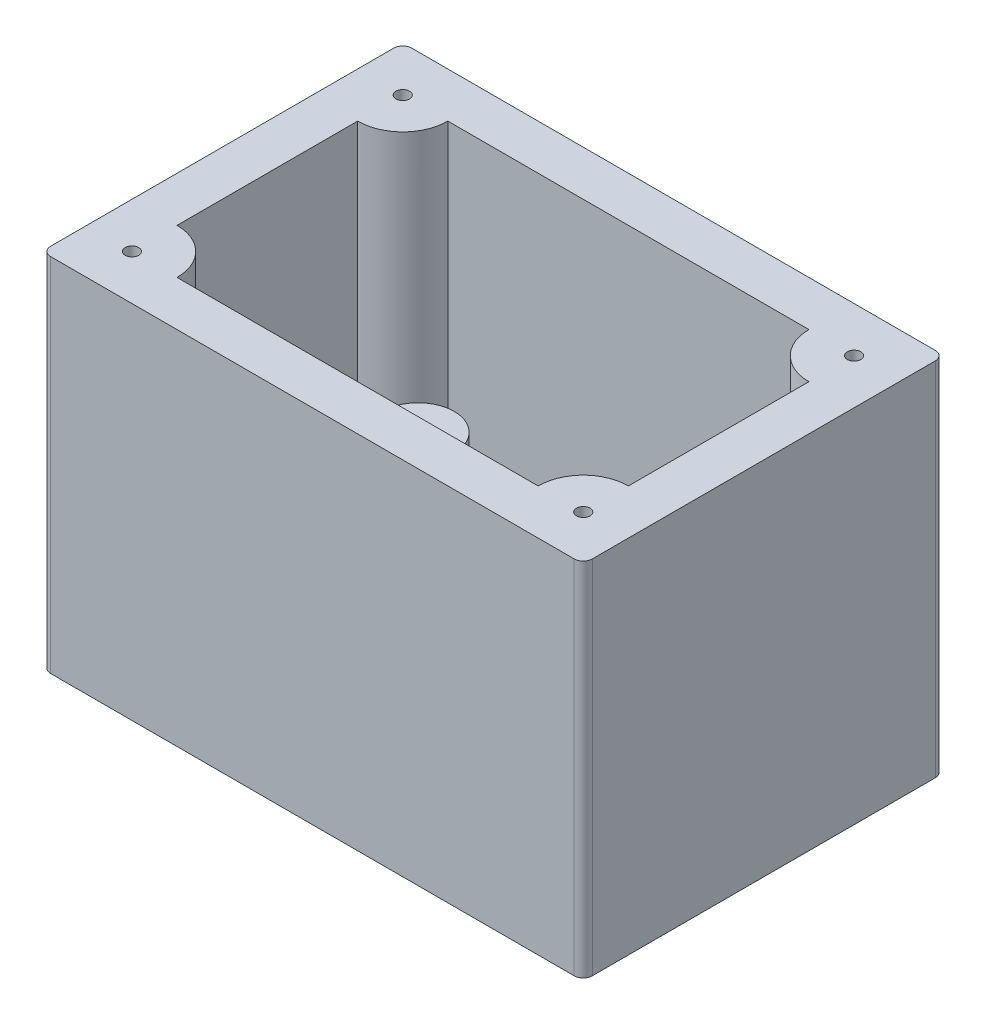
ISO-10303-21;
HEADER;
FILE_DESCRIPTION(('STEP AP214'),'2;1');
FILE_NAME('part.step','',(''),(''),'','','');
FILE_SCHEMA(('AUTOMOTIVE_DESIGN { 1 0 10303 214 1 1 1 1 }'));
ENDSEC;
DATA;
#1=APPLICATION_CONTEXT('core data for automotive mechanical design processes');
#2=APPLICATION_PROTOCOL_DEFINITION('international standard','automotive_design',2000,#1);
#3=PRODUCT_CONTEXT('',#1,'mechanical');
#4=PRODUCT('Part','Part','',(#3));
#5=PRODUCT_RELATED_PRODUCT_CATEGORY('part','',(#4));
#6=PRODUCT_DEFINITION_FORMATION('','',#4);
#7=PRODUCT_DEFINITION_CONTEXT('part definition',#1,'design');
#8=PRODUCT_DEFINITION('design','',#6,#7);
#9=PRODUCT_DEFINITION_SHAPE('','',#8);
#10=(LENGTH_UNIT() NAMED_UNIT(*) SI_UNIT(.MILLI.,.METRE.));
#11=(NAMED_UNIT(*) PLANE_ANGLE_UNIT() SI_UNIT($,.RADIAN.));
#12=(NAMED_UNIT(*) SI_UNIT($,.STERADIAN.) SOLID_ANGLE_UNIT());
#13=UNCERTAINTY_MEASURE_WITH_UNIT(LENGTH_MEASURE(1.E-05),#10,'distance_accuracy_value','');
#14=(GEOMETRIC_REPRESENTATION_CONTEXT(3) GLOBAL_UNCERTAINTY_ASSIGNED_CONTEXT((#13)) GLOBAL_UNIT_ASSIGNED_CONTEXT((#10,
#11,#12)) REPRESENTATION_CONTEXT('',''));
#15=CARTESIAN_POINT('',(0.,0.,0.));
#16=DIRECTION('',(0.,0.,1.));
#17=DIRECTION('',(1.,0.,0.));
#18=AXIS2_PLACEMENT_3D('',#15,#16,#17);
#19=CARTESIAN_POINT('',(0.,5.,0.));
#20=DIRECTION('',(0.,-1.,0.));
#21=DIRECTION('',(0.,0.,-1.));
#22=AXIS2_PLACEMENT_3D('',#19,#20,#21);
#23=PLANE('',#22);
#24=DIRECTION('',(1.,0.,0.));
#25=VECTOR('',#24,1.);
#26=CARTESIAN_POINT('',(0.,5.,0.));
#27=LINE('',#26,#25);
#28=CARTESIAN_POINT('',(5.,5.,0.));
#29=VERTEX_POINT('',#28);
#30=CARTESIAN_POINT('',(45.,5.,0.));
#31=VERTEX_POINT('',#30);
#32=EDGE_CURVE('E216',#29,#31,#27,.T.);
#33=ORIENTED_EDGE('',*,*,#32,.F.);
#34=CARTESIAN_POINT('',(0.,5.,0.));
#35=DIRECTION('',(0.,-1.,0.));
#36=DIRECTION('',(0.,0.,-1.));
#37=AXIS2_PLACEMENT_3D('',#34,#35,#36);
#38=CIRCLE('',#37,5.);
#39=CARTESIAN_POINT('',(4.17386888557631,5.,2.75296540588835));
#40=VERTEX_POINT('',#39);
#41=EDGE_CURVE('E164',#29,#40,#38,.T.);
#42=ORIENTED_EDGE('',*,*,#41,.T.);
#43=CARTESIAN_POINT('',(8.2,5.,6.5));
#44=DIRECTION('',(0.,-1.,0.));
#45=DIRECTION('',(0.,0.,-1.));
#46=AXIS2_PLACEMENT_3D('',#43,#44,#45);
#47=CIRCLE('',#46,5.5);
#48=CARTESIAN_POINT('',(3.63294452204083,5.,3.43536229527157));
#49=VERTEX_POINT('',#48);
#50=EDGE_CURVE('E226',#40,#49,#47,.T.);
#51=ORIENTED_EDGE('',*,*,#50,.T.);
#52=CARTESIAN_POINT('',(0.,5.,5.));
#53=VERTEX_POINT('',#52);
#54=EDGE_CURVE('E414',#49,#53,#38,.T.);
#55=ORIENTED_EDGE('',*,*,#54,.T.);
#56=DIRECTION('',(0.,0.,1.));
#57=VECTOR('',#56,1.);
#58=CARTESIAN_POINT('',(0.,5.,0.));
#59=LINE('',#58,#57);
#60=CARTESIAN_POINT('',(0.,5.,25.));
#61=VERTEX_POINT('',#60);
#62=EDGE_CURVE('E218',#53,#61,#59,.T.);
#63=ORIENTED_EDGE('',*,*,#62,.T.);
#64=CARTESIAN_POINT('',(0.,5.,30.));
#65=DIRECTION('',(0.,-1.,0.));
#66=DIRECTION('',(0.,0.,-1.));
#67=AXIS2_PLACEMENT_3D('',#64,#65,#66);
#68=CIRCLE('',#67,5.);
#69=CARTESIAN_POINT('',(5.,5.,30.));
#70=VERTEX_POINT('',#69);
#71=EDGE_CURVE('E389',#61,#70,#68,.T.);
#72=ORIENTED_EDGE('',*,*,#71,.T.);
#73=DIRECTION('',(1.,0.,0.));
#74=VECTOR('',#73,1.);
#75=CARTESIAN_POINT('',(0.,5.,30.));
#76=LINE('',#75,#74);
#77=CARTESIAN_POINT('',(45.,5.,30.));
#78=VERTEX_POINT('',#77);
#79=EDGE_CURVE('E204',#70,#78,#76,.T.);
#80=ORIENTED_EDGE('',*,*,#79,.T.);
#81=CARTESIAN_POINT('',(50.,5.,30.));
#82=DIRECTION('',(0.,-1.,0.));
#83=DIRECTION('',(0.,0.,-1.));
#84=AXIS2_PLACEMENT_3D('',#81,#82,#83);
#85=CIRCLE('',#84,5.);
#86=CARTESIAN_POINT('',(45.8261311144237,5.,27.2470345941117));
#87=VERTEX_POINT('',#86);
#88=EDGE_CURVE('E383',#78,#87,#85,.T.);
#89=ORIENTED_EDGE('',*,*,#88,.T.);
#90=CARTESIAN_POINT('',(41.8,5.,23.5));
#91=DIRECTION('',(0.,-1.,0.));
#92=DIRECTION('',(0.,0.,-1.));
#93=AXIS2_PLACEMENT_3D('',#90,#91,#92);
#94=CIRCLE('',#93,5.50000000000001);
#95=CARTESIAN_POINT('',(46.3670554779592,5.,26.5646377047284));
#96=VERTEX_POINT('',#95);
#97=EDGE_CURVE('E223',#87,#96,#94,.T.);
#98=ORIENTED_EDGE('',*,*,#97,.T.);
#99=CARTESIAN_POINT('',(50.,5.,25.));
#100=VERTEX_POINT('',#99);
#101=EDGE_CURVE('E380',#96,#100,#85,.T.);
#102=ORIENTED_EDGE('',*,*,#101,.T.);
#103=DIRECTION('',(0.,0.,1.));
#104=VECTOR('',#103,1.);
#105=CARTESIAN_POINT('',(50.,5.,0.));
#106=LINE('',#105,#104);
#107=CARTESIAN_POINT('',(50.,5.,5.00000000000002));
#108=VERTEX_POINT('',#107);
#109=EDGE_CURVE('E214',#108,#100,#106,.T.);
#110=ORIENTED_EDGE('',*,*,#109,.F.);
#111=CARTESIAN_POINT('',(50.,5.,0.));
#112=DIRECTION('',(0.,-1.,0.));
#113=DIRECTION('',(0.,0.,-1.));
#114=AXIS2_PLACEMENT_3D('',#111,#112,#113);
#115=CIRCLE('',#114,5.00000000000002);
#116=EDGE_CURVE('E371',#108,#31,#115,.T.);
#117=ORIENTED_EDGE('',*,*,#116,.T.);
#118=EDGE_LOOP('',(#33,#42,#51,#55,#63,#72,#80,#89,#98,#102,#110,#117));
#119=FACE_BOUND('',#118,.T.);
#120=ADVANCED_FACE('F33',(#119),#23,.F.);
#121=CARTESIAN_POINT('',(0.,40.,0.));
#122=DIRECTION('',(1.,0.,0.));
#123=DIRECTION('',(0.,0.,-1.));
#124=AXIS2_PLACEMENT_3D('',#121,#122,#123);
#125=PLANE('',#124);
#126=DIRECTION('',(0.,1.,0.));
#127=VECTOR('',#126,1.);
#128=CARTESIAN_POINT('',(0.,-7.0710678118655,5.));
#129=LINE('',#128,#127);
#130=CARTESIAN_POINT('',(0.,40.,5.));
#131=VERTEX_POINT('',#130);
#132=EDGE_CURVE('E168',#53,#131,#129,.T.);
#133=ORIENTED_EDGE('',*,*,#132,.T.);
#134=DIRECTION('',(0.,0.,1.));
#135=VECTOR('',#134,1.);
#136=CARTESIAN_POINT('',(0.,40.,0.));
#137=LINE('',#136,#135);
#138=CARTESIAN_POINT('',(0.,40.,25.));
#139=VERTEX_POINT('',#138);
#140=EDGE_CURVE('E177',#131,#139,#137,.T.);
#141=ORIENTED_EDGE('',*,*,#140,.T.);
#142=DIRECTION('',(0.,1.,0.));
#143=VECTOR('',#142,1.);
#144=CARTESIAN_POINT('',(0.,-7.0710678118655,25.));
#145=LINE('',#144,#143);
#146=EDGE_CURVE('E385',#61,#139,#145,.T.);
#147=ORIENTED_EDGE('',*,*,#146,.F.);
#148=ORIENTED_EDGE('',*,*,#62,.F.);
#149=EDGE_LOOP('',(#133,#141,#147,#148));
#150=FACE_BOUND('',#149,.T.);
#151=ADVANCED_FACE('F306',(#150),#125,.T.);
#152=CARTESIAN_POINT('',(0.,40.,30.));
#153=DIRECTION('',(0.,0.,-1.));
#154=DIRECTION('',(-1.,0.,0.));
#155=AXIS2_PLACEMENT_3D('',#152,#153,#154);
#156=PLANE('',#155);
#157=DIRECTION('',(0.,1.,0.));
#158=VECTOR('',#157,1.);
#159=CARTESIAN_POINT('',(45.,-7.0710678118655,30.));
#160=LINE('',#159,#158);
#161=CARTESIAN_POINT('',(45.,40.,30.));
#162=VERTEX_POINT('',#161);
#163=EDGE_CURVE('E361',#78,#162,#160,.T.);
#164=ORIENTED_EDGE('',*,*,#163,.F.);
#165=ORIENTED_EDGE('',*,*,#79,.F.);
#166=DIRECTION('',(0.,1.,0.));
#167=VECTOR('',#166,1.);
#168=CARTESIAN_POINT('',(5.,-7.0710678118655,30.));
#169=LINE('',#168,#167);
#170=CARTESIAN_POINT('',(5.,40.,30.));
#171=VERTEX_POINT('',#170);
#172=EDGE_CURVE('E363',#70,#171,#169,.T.);
#173=ORIENTED_EDGE('',*,*,#172,.T.);
#174=DIRECTION('',(1.,0.,0.));
#175=VECTOR('',#174,1.);
#176=CARTESIAN_POINT('',(0.,40.,30.));
#177=LINE('',#176,#175);
#178=EDGE_CURVE('E190',#171,#162,#177,.T.);
#179=ORIENTED_EDGE('',*,*,#178,.T.);
#180=EDGE_LOOP('',(#164,#165,#173,#179));
#181=FACE_BOUND('',#180,.T.);
#182=ADVANCED_FACE('F302',(#181),#156,.T.);
#183=CARTESIAN_POINT('',(50.,40.,0.));
#184=DIRECTION('',(-1.,0.,0.));
#185=DIRECTION('',(0.,0.,1.));
#186=AXIS2_PLACEMENT_3D('',#183,#184,#185);
#187=PLANE('',#186);
#188=DIRECTION('',(0.,1.,0.));
#189=VECTOR('',#188,1.);
#190=CARTESIAN_POINT('',(50.,-7.0710678118655,5.00000000000002));
#191=LINE('',#190,#189);
#192=CARTESIAN_POINT('',(50.,40.,5.00000000000002));
#193=VERTEX_POINT('',#192);
#194=EDGE_CURVE('E420',#108,#193,#191,.T.);
#195=ORIENTED_EDGE('',*,*,#194,.F.);
#196=ORIENTED_EDGE('',*,*,#109,.T.);
#197=DIRECTION('',(0.,1.,0.));
#198=VECTOR('',#197,1.);
#199=CARTESIAN_POINT('',(50.,-7.0710678118655,25.));
#200=LINE('',#199,#198);
#201=CARTESIAN_POINT('',(50.,40.,25.));
#202=VERTEX_POINT('',#201);
#203=EDGE_CURVE('E373',#100,#202,#200,.T.);
#204=ORIENTED_EDGE('',*,*,#203,.T.);
#205=DIRECTION('',(0.,0.,-1.));
#206=VECTOR('',#205,1.);
#207=CARTESIAN_POINT('',(50.,40.,0.));
#208=LINE('',#207,#206);
#209=EDGE_CURVE('E185',#202,#193,#208,.T.);
#210=ORIENTED_EDGE('',*,*,#209,.T.);
#211=EDGE_LOOP('',(#195,#196,#204,#210));
#212=FACE_BOUND('',#211,.T.);
#213=ADVANCED_FACE('F299',(#212),#187,.T.);
#214=CARTESIAN_POINT('',(0.,40.,0.));
#215=DIRECTION('',(0.,0.,1.));
#216=DIRECTION('',(1.,0.,0.));
#217=AXIS2_PLACEMENT_3D('',#214,#215,#216);
#218=PLANE('',#217);
#219=DIRECTION('',(0.,1.,0.));
#220=VECTOR('',#219,1.);
#221=CARTESIAN_POINT('',(5.,-7.0710678118655,0.));
#222=LINE('',#221,#220);
#223=CARTESIAN_POINT('',(5.,40.,0.));
#224=VERTEX_POINT('',#223);
#225=EDGE_CURVE('E158',#29,#224,#222,.T.);
#226=ORIENTED_EDGE('',*,*,#225,.F.);
#227=ORIENTED_EDGE('',*,*,#32,.T.);
#228=DIRECTION('',(0.,1.,0.));
#229=VECTOR('',#228,1.);
#230=CARTESIAN_POINT('',(45.,-7.0710678118655,0.));
#231=LINE('',#230,#229);
#232=CARTESIAN_POINT('',(45.,40.,0.));
#233=VERTEX_POINT('',#232);
#234=EDGE_CURVE('E182',#31,#233,#231,.T.);
#235=ORIENTED_EDGE('',*,*,#234,.T.);
#236=DIRECTION('',(-1.,0.,0.));
#237=VECTOR('',#236,1.);
#238=CARTESIAN_POINT('',(0.,40.,0.));
#239=LINE('',#238,#237);
#240=EDGE_CURVE('E174',#233,#224,#239,.T.);
#241=ORIENTED_EDGE('',*,*,#240,.T.);
#242=EDGE_LOOP('',(#226,#227,#235,#241));
#243=FACE_BOUND('',#242,.T.);
#244=ADVANCED_FACE('F180',(#243),#218,.T.);
#245=CARTESIAN_POINT('',(0.,40.,0.));
#246=DIRECTION('',(0.,1.,0.));
#247=DIRECTION('',(0.,0.,1.));
#248=AXIS2_PLACEMENT_3D('',#245,#246,#247);
#249=PLANE('',#248);
#250=CARTESIAN_POINT('',(0.,40.,30.));
#251=DIRECTION('',(0.,1.,0.));
#252=DIRECTION('',(0.,0.,-1.));
#253=AXIS2_PLACEMENT_3D('',#250,#251,#252);
#254=CIRCLE('',#253,0.75);
#255=CARTESIAN_POINT('',(0.,40.,29.25));
#256=VERTEX_POINT('',#255);
#257=EDGE_CURVE('E744',#256,#256,#254,.T.);
#258=ORIENTED_EDGE('',*,*,#257,.F.);
#259=EDGE_LOOP('',(#258));
#260=FACE_BOUND('',#259,.T.);
#261=CARTESIAN_POINT('',(50.,40.,0.));
#262=DIRECTION('',(0.,1.,0.));
#263=DIRECTION('',(0.,0.,-1.));
#264=AXIS2_PLACEMENT_3D('',#261,#262,#263);
#265=CIRCLE('',#264,0.749999999999999);
#266=CARTESIAN_POINT('',(50.,40.,-0.749999999999995));
#267=VERTEX_POINT('',#266);
#268=EDGE_CURVE('E738',#267,#267,#265,.T.);
#269=ORIENTED_EDGE('',*,*,#268,.F.);
#270=EDGE_LOOP('',(#269));
#271=FACE_BOUND('',#270,.T.);
#272=CARTESIAN_POINT('',(0.,40.,0.));
#273=DIRECTION('',(0.,1.,0.));
#274=DIRECTION('',(0.,0.,1.));
#275=AXIS2_PLACEMENT_3D('',#272,#273,#274);
#276=CIRCLE('',#275,0.75);
#277=CARTESIAN_POINT('',(0.,40.,0.75));
#278=VERTEX_POINT('',#277);
#279=EDGE_CURVE('E735',#278,#278,#276,.T.);
#280=ORIENTED_EDGE('',*,*,#279,.F.);
#281=EDGE_LOOP('',(#280));
#282=FACE_BOUND('',#281,.T.);
#283=CARTESIAN_POINT('',(50.,40.,30.));
#284=DIRECTION('',(0.,1.,0.));
#285=DIRECTION('',(0.,0.,1.));
#286=AXIS2_PLACEMENT_3D('',#283,#284,#285);
#287=CIRCLE('',#286,0.749999999999999);
#288=CARTESIAN_POINT('',(50.,40.,30.75));
#289=VERTEX_POINT('',#288);
#290=EDGE_CURVE('E743',#289,#289,#287,.T.);
#291=ORIENTED_EDGE('',*,*,#290,.F.);
#292=EDGE_LOOP('',(#291));
#293=FACE_BOUND('',#292,.T.);
#294=DIRECTION('',(0.,0.,1.));
#295=VECTOR('',#294,1.);
#296=CARTESIAN_POINT('',(-5.,40.,-5.));
#297=LINE('',#296,#295);
#298=CARTESIAN_POINT('',(-5.,40.,-4.));
#299=VERTEX_POINT('',#298);
#300=CARTESIAN_POINT('',(-5.,40.,34.));
#301=VERTEX_POINT('',#300);
#302=EDGE_CURVE('E194',#299,#301,#297,.T.);
#303=ORIENTED_EDGE('',*,*,#302,.T.);
#304=CARTESIAN_POINT('',(-4.,40.,34.));
#305=DIRECTION('',(0.,1.,0.));
#306=DIRECTION('',(0.,0.,1.));
#307=AXIS2_PLACEMENT_3D('',#304,#305,#306);
#308=CIRCLE('',#307,1.);
#309=CARTESIAN_POINT('',(-4.,40.,35.));
#310=VERTEX_POINT('',#309);
#311=EDGE_CURVE('E453',#301,#310,#308,.T.);
#312=ORIENTED_EDGE('',*,*,#311,.T.);
#313=DIRECTION('',(1.,0.,0.));
#314=VECTOR('',#313,1.);
#315=CARTESIAN_POINT('',(-5.,40.,35.));
#316=LINE('',#315,#314);
#317=CARTESIAN_POINT('',(54.,40.,35.));
#318=VERTEX_POINT('',#317);
#319=EDGE_CURVE('E197',#310,#318,#316,.T.);
#320=ORIENTED_EDGE('',*,*,#319,.T.);
#321=CARTESIAN_POINT('',(54.,40.,34.));
#322=DIRECTION('',(0.,1.,0.));
#323=DIRECTION('',(0.,0.,1.));
#324=AXIS2_PLACEMENT_3D('',#321,#322,#323);
#325=CIRCLE('',#324,1.);
#326=CARTESIAN_POINT('',(55.,40.,34.));
#327=VERTEX_POINT('',#326);
#328=EDGE_CURVE('E448',#318,#327,#325,.T.);
#329=ORIENTED_EDGE('',*,*,#328,.T.);
#330=DIRECTION('',(0.,0.,-1.));
#331=VECTOR('',#330,1.);
#332=CARTESIAN_POINT('',(55.,40.,-5.));
#333=LINE('',#332,#331);
#334=CARTESIAN_POINT('',(55.,40.,-4.));
#335=VERTEX_POINT('',#334);
#336=EDGE_CURVE('E201',#327,#335,#333,.T.);
#337=ORIENTED_EDGE('',*,*,#336,.T.);
#338=CARTESIAN_POINT('',(54.,40.,-4.));
#339=DIRECTION('',(0.,1.,0.));
#340=DIRECTION('',(0.,0.,1.));
#341=AXIS2_PLACEMENT_3D('',#338,#339,#340);
#342=CIRCLE('',#341,1.);
#343=CARTESIAN_POINT('',(54.,40.,-5.));
#344=VERTEX_POINT('',#343);
#345=EDGE_CURVE('E55',#335,#344,#342,.T.);
#346=ORIENTED_EDGE('',*,*,#345,.T.);
#347=DIRECTION('',(-1.,0.,0.));
#348=VECTOR('',#347,1.);
#349=CARTESIAN_POINT('',(-5.,40.,-5.));
#350=LINE('',#349,#348);
#351=CARTESIAN_POINT('',(-4.,40.,-5.));
#352=VERTEX_POINT('',#351);
#353=EDGE_CURVE('E203',#344,#352,#350,.T.);
#354=ORIENTED_EDGE('',*,*,#353,.T.);
#355=CARTESIAN_POINT('',(-4.,40.,-4.));
#356=DIRECTION('',(0.,1.,0.));
#357=DIRECTION('',(0.,0.,1.));
#358=AXIS2_PLACEMENT_3D('',#355,#356,#357);
#359=CIRCLE('',#358,1.);
#360=EDGE_CURVE('E451',#352,#299,#359,.T.);
#361=ORIENTED_EDGE('',*,*,#360,.T.);
#362=EDGE_LOOP('',(#303,#312,#320,#329,#337,#346,#354,#361));
#363=FACE_BOUND('',#362,.T.);
#364=ORIENTED_EDGE('',*,*,#178,.F.);
#365=CARTESIAN_POINT('',(0.,40.,30.));
#366=DIRECTION('',(0.,1.,0.));
#367=DIRECTION('',(0.,0.,1.));
#368=AXIS2_PLACEMENT_3D('',#365,#366,#367);
#369=CIRCLE('',#368,5.);
#370=EDGE_CURVE('E366',#171,#139,#369,.T.);
#371=ORIENTED_EDGE('',*,*,#370,.T.);
#372=ORIENTED_EDGE('',*,*,#140,.F.);
#373=CARTESIAN_POINT('',(0.,40.,0.));
#374=DIRECTION('',(0.,1.,0.));
#375=DIRECTION('',(0.,0.,1.));
#376=AXIS2_PLACEMENT_3D('',#373,#374,#375);
#377=CIRCLE('',#376,5.);
#378=EDGE_CURVE('E161',#131,#224,#377,.T.);
#379=ORIENTED_EDGE('',*,*,#378,.T.);
#380=ORIENTED_EDGE('',*,*,#240,.F.);
#381=CARTESIAN_POINT('',(50.,40.,0.));
#382=DIRECTION('',(0.,1.,0.));
#383=DIRECTION('',(0.,0.,1.));
#384=AXIS2_PLACEMENT_3D('',#381,#382,#383);
#385=CIRCLE('',#384,5.00000000000002);
#386=EDGE_CURVE('E418',#233,#193,#385,.T.);
#387=ORIENTED_EDGE('',*,*,#386,.T.);
#388=ORIENTED_EDGE('',*,*,#209,.F.);
#389=CARTESIAN_POINT('',(50.,40.,30.));
#390=DIRECTION('',(0.,1.,0.));
#391=DIRECTION('',(0.,0.,1.));
#392=AXIS2_PLACEMENT_3D('',#389,#390,#391);
#393=CIRCLE('',#392,5.);
#394=EDGE_CURVE('E368',#202,#162,#393,.T.);
#395=ORIENTED_EDGE('',*,*,#394,.T.);
#396=EDGE_LOOP('',(#364,#371,#372,#379,#380,#387,#388,#395));
#397=FACE_BOUND('',#396,.T.);
#398=ADVANCED_FACE('F172',(#260,#271,#282,#293,#363,#397),#249,.T.);
#399=CARTESIAN_POINT('',(-5.,40.,-5.));
#400=DIRECTION('',(1.,0.,0.));
#401=DIRECTION('',(0.,0.,-1.));
#402=AXIS2_PLACEMENT_3D('',#399,#400,#401);
#403=PLANE('',#402);
#404=DIRECTION('',(0.,0.,1.));
#405=VECTOR('',#404,1.);
#406=CARTESIAN_POINT('',(-5.,0.,-5.));
#407=LINE('',#406,#405);
#408=CARTESIAN_POINT('',(-5.,0.,-4.));
#409=VERTEX_POINT('',#408);
#410=CARTESIAN_POINT('',(-5.,0.,34.));
#411=VERTEX_POINT('',#410);
#412=EDGE_CURVE('E184',#409,#411,#407,.T.);
#413=ORIENTED_EDGE('',*,*,#412,.T.);
#414=DIRECTION('',(0.,-1.,0.));
#415=VECTOR('',#414,1.);
#416=CARTESIAN_POINT('',(-5.,40.,34.));
#417=LINE('',#416,#415);
#418=EDGE_CURVE('E446',#411,#301,#417,.F.);
#419=ORIENTED_EDGE('',*,*,#418,.T.);
#420=ORIENTED_EDGE('',*,*,#302,.F.);
#421=DIRECTION('',(0.,-1.,0.));
#422=VECTOR('',#421,1.);
#423=CARTESIAN_POINT('',(-5.,40.,-4.));
#424=LINE('',#423,#422);
#425=EDGE_CURVE('E443',#299,#409,#424,.T.);
#426=ORIENTED_EDGE('',*,*,#425,.T.);
#427=EDGE_LOOP('',(#413,#419,#420,#426));
#428=FACE_BOUND('',#427,.T.);
#429=ADVANCED_FACE('F313',(#428),#403,.F.);
#430=CARTESIAN_POINT('',(-5.,40.,35.));
#431=DIRECTION('',(0.,0.,-1.));
#432=DIRECTION('',(-1.,0.,0.));
#433=AXIS2_PLACEMENT_3D('',#430,#431,#432);
#434=PLANE('',#433);
#435=ORIENTED_EDGE('',*,*,#319,.F.);
#436=DIRECTION('',(0.,-1.,0.));
#437=VECTOR('',#436,1.);
#438=CARTESIAN_POINT('',(-4.,40.,35.));
#439=LINE('',#438,#437);
#440=CARTESIAN_POINT('',(-4.,0.,35.));
#441=VERTEX_POINT('',#440);
#442=EDGE_CURVE('E429',#310,#441,#439,.T.);
#443=ORIENTED_EDGE('',*,*,#442,.T.);
#444=DIRECTION('',(1.,0.,0.));
#445=VECTOR('',#444,1.);
#446=CARTESIAN_POINT('',(-5.,0.,35.));
#447=LINE('',#446,#445);
#448=CARTESIAN_POINT('',(54.,0.,35.));
#449=VERTEX_POINT('',#448);
#450=EDGE_CURVE('E188',#441,#449,#447,.T.);
#451=ORIENTED_EDGE('',*,*,#450,.T.);
#452=DIRECTION('',(0.,-1.,0.));
#453=VECTOR('',#452,1.);
#454=CARTESIAN_POINT('',(54.,40.,35.));
#455=LINE('',#454,#453);
#456=EDGE_CURVE('E428',#449,#318,#455,.F.);
#457=ORIENTED_EDGE('',*,*,#456,.T.);
#458=EDGE_LOOP('',(#435,#443,#451,#457));
#459=FACE_BOUND('',#458,.T.);
#460=ADVANCED_FACE('F321',(#459),#434,.F.);
#461=CARTESIAN_POINT('',(55.,40.,-5.));
#462=DIRECTION('',(-1.,0.,0.));
#463=DIRECTION('',(0.,0.,1.));
#464=AXIS2_PLACEMENT_3D('',#461,#462,#463);
#465=PLANE('',#464);
#466=DIRECTION('',(0.,0.,-1.));
#467=VECTOR('',#466,1.);
#468=CARTESIAN_POINT('',(55.,0.,-5.));
#469=LINE('',#468,#467);
#470=CARTESIAN_POINT('',(55.,0.,34.));
#471=VERTEX_POINT('',#470);
#472=CARTESIAN_POINT('',(55.,0.,-4.));
#473=VERTEX_POINT('',#472);
#474=EDGE_CURVE('E208',#471,#473,#469,.T.);
#475=ORIENTED_EDGE('',*,*,#474,.T.);
#476=DIRECTION('',(0.,-1.,0.));
#477=VECTOR('',#476,1.);
#478=CARTESIAN_POINT('',(55.,40.,-4.));
#479=LINE('',#478,#477);
#480=EDGE_CURVE('E11',#473,#335,#479,.F.);
#481=ORIENTED_EDGE('',*,*,#480,.T.);
#482=ORIENTED_EDGE('',*,*,#336,.F.);
#483=DIRECTION('',(0.,-1.,0.));
#484=VECTOR('',#483,1.);
#485=CARTESIAN_POINT('',(55.,40.,34.));
#486=LINE('',#485,#484);
#487=EDGE_CURVE('E41',#327,#471,#486,.T.);
#488=ORIENTED_EDGE('',*,*,#487,.T.);
#489=EDGE_LOOP('',(#475,#481,#482,#488));
#490=FACE_BOUND('',#489,.T.);
#491=ADVANCED_FACE('F318',(#490),#465,.F.);
#492=CARTESIAN_POINT('',(-5.,40.,-5.));
#493=DIRECTION('',(0.,0.,1.));
#494=DIRECTION('',(1.,0.,0.));
#495=AXIS2_PLACEMENT_3D('',#492,#493,#494);
#496=PLANE('',#495);
#497=DIRECTION('',(-1.,0.,0.));
#498=VECTOR('',#497,1.);
#499=CARTESIAN_POINT('',(-5.,0.,-5.));
#500=LINE('',#499,#498);
#501=CARTESIAN_POINT('',(54.,0.,-5.));
#502=VERTEX_POINT('',#501);
#503=CARTESIAN_POINT('',(-4.,0.,-5.));
#504=VERTEX_POINT('',#503);
#505=EDGE_CURVE('E198',#502,#504,#500,.T.);
#506=ORIENTED_EDGE('',*,*,#505,.T.);
#507=DIRECTION('',(0.,-1.,0.));
#508=VECTOR('',#507,1.);
#509=CARTESIAN_POINT('',(-4.,40.,-5.));
#510=LINE('',#509,#508);
#511=EDGE_CURVE('E48',#504,#352,#510,.F.);
#512=ORIENTED_EDGE('',*,*,#511,.T.);
#513=ORIENTED_EDGE('',*,*,#353,.F.);
#514=DIRECTION('',(0.,-1.,0.));
#515=VECTOR('',#514,1.);
#516=CARTESIAN_POINT('',(54.,40.,-5.));
#517=LINE('',#516,#515);
#518=EDGE_CURVE('E455',#344,#502,#517,.T.);
#519=ORIENTED_EDGE('',*,*,#518,.T.);
#520=EDGE_LOOP('',(#506,#512,#513,#519));
#521=FACE_BOUND('',#520,.T.);
#522=ADVANCED_FACE('F315',(#521),#496,.F.);
#523=CARTESIAN_POINT('',(0.,0.,0.));
#524=DIRECTION('',(0.,-1.,0.));
#525=DIRECTION('',(0.,0.,-1.));
#526=AXIS2_PLACEMENT_3D('',#523,#524,#525);
#527=PLANE('',#526);
#528=ORIENTED_EDGE('',*,*,#450,.F.);
#529=CARTESIAN_POINT('',(-4.,0.,34.));
#530=DIRECTION('',(0.,-1.,0.));
#531=DIRECTION('',(0.,0.,-1.));
#532=AXIS2_PLACEMENT_3D('',#529,#530,#531);
#533=CIRCLE('',#532,1.);
#534=EDGE_CURVE('E441',#441,#411,#533,.T.);
#535=ORIENTED_EDGE('',*,*,#534,.T.);
#536=ORIENTED_EDGE('',*,*,#412,.F.);
#537=CARTESIAN_POINT('',(-4.,0.,-4.));
#538=DIRECTION('',(0.,-1.,0.));
#539=DIRECTION('',(0.,0.,-1.));
#540=AXIS2_PLACEMENT_3D('',#537,#538,#539);
#541=CIRCLE('',#540,1.);
#542=EDGE_CURVE('E439',#409,#504,#541,.T.);
#543=ORIENTED_EDGE('',*,*,#542,.T.);
#544=ORIENTED_EDGE('',*,*,#505,.F.);
#545=CARTESIAN_POINT('',(54.,0.,-4.));
#546=DIRECTION('',(0.,-1.,0.));
#547=DIRECTION('',(0.,0.,-1.));
#548=AXIS2_PLACEMENT_3D('',#545,#546,#547);
#549=CIRCLE('',#548,1.);
#550=EDGE_CURVE('E437',#502,#473,#549,.T.);
#551=ORIENTED_EDGE('',*,*,#550,.T.);
#552=ORIENTED_EDGE('',*,*,#474,.F.);
#553=CARTESIAN_POINT('',(54.,0.,34.));
#554=DIRECTION('',(0.,-1.,0.));
#555=DIRECTION('',(0.,0.,-1.));
#556=AXIS2_PLACEMENT_3D('',#553,#554,#555);
#557=CIRCLE('',#556,1.);
#558=EDGE_CURVE('E433',#471,#449,#557,.T.);
#559=ORIENTED_EDGE('',*,*,#558,.T.);
#560=EDGE_LOOP('',(#528,#535,#536,#543,#544,#551,#552,#559));
#561=FACE_BOUND('',#560,.T.);
#562=ADVANCED_FACE('F295',(#561),#527,.T.);
#563=CARTESIAN_POINT('',(8.2,15.,6.5));
#564=DIRECTION('',(0.,-1.,0.));
#565=DIRECTION('',(0.,0.,-1.));
#566=AXIS2_PLACEMENT_3D('',#563,#564,#565);
#567=CYLINDRICAL_SURFACE('',#566,4.);
#568=CARTESIAN_POINT('',(8.2,6.5,6.5));
#569=DIRECTION('',(0.,-1.,0.));
#570=DIRECTION('',(0.,0.,-1.));
#571=AXIS2_PLACEMENT_3D('',#568,#569,#570);
#572=CIRCLE('',#571,4.);
#573=CARTESIAN_POINT('',(8.2,6.5,2.5));
#574=VERTEX_POINT('',#573);
#575=EDGE_CURVE('E220',#574,#574,#572,.F.);
#576=ORIENTED_EDGE('',*,*,#575,.T.);
#577=EDGE_LOOP('',(#576));
#578=FACE_BOUND('',#577,.T.);
#579=CARTESIAN_POINT('',(8.2,15.,6.5));
#580=DIRECTION('',(0.,1.,0.));
#581=DIRECTION('',(0.,0.,1.));
#582=AXIS2_PLACEMENT_3D('',#579,#580,#581);
#583=CIRCLE('',#582,4.);
#584=CARTESIAN_POINT('',(8.2,15.,10.5));
#585=VERTEX_POINT('',#584);
#586=EDGE_CURVE('E348',#585,#585,#583,.T.);
#587=ORIENTED_EDGE('',*,*,#586,.F.);
#588=EDGE_LOOP('',(#587));
#589=FACE_BOUND('',#588,.T.);
#590=ADVANCED_FACE('F291',(#578,#589),#567,.T.);
#591=CARTESIAN_POINT('',(8.2,15.,6.5));
#592=DIRECTION('',(0.,1.,0.));
#593=DIRECTION('',(0.,0.,1.));
#594=AXIS2_PLACEMENT_3D('',#591,#592,#593);
#595=PLANE('',#594);
#596=CARTESIAN_POINT('',(8.1,15.,6.60000000000005));
#597=DIRECTION('',(0.,1.,0.));
#598=DIRECTION('',(0.,0.,1.));
#599=AXIS2_PLACEMENT_3D('',#596,#597,#598);
#600=CIRCLE('',#599,0.75);
#601=CARTESIAN_POINT('',(8.1,15.,7.35000000000005));
#602=VERTEX_POINT('',#601);
#603=EDGE_CURVE('E391',#602,#602,#600,.T.);
#604=ORIENTED_EDGE('',*,*,#603,.F.);
#605=EDGE_LOOP('',(#604));
#606=FACE_BOUND('',#605,.T.);
#607=ORIENTED_EDGE('',*,*,#586,.T.);
#608=EDGE_LOOP('',(#607));
#609=FACE_BOUND('',#608,.T.);
#610=ADVANCED_FACE('F287',(#606,#609),#595,.T.);
#611=CARTESIAN_POINT('',(41.8,15.,23.5));
#612=DIRECTION('',(0.,-1.,0.));
#613=DIRECTION('',(0.,0.,-1.));
#614=AXIS2_PLACEMENT_3D('',#611,#612,#613);
#615=CYLINDRICAL_SURFACE('',#614,4.00000000000001);
#616=CARTESIAN_POINT('',(41.8,6.5,23.5));
#617=DIRECTION('',(0.,-1.,0.));
#618=DIRECTION('',(0.,0.,-1.));
#619=AXIS2_PLACEMENT_3D('',#616,#617,#618);
#620=CIRCLE('',#619,4.00000000000001);
#621=CARTESIAN_POINT('',(41.8,6.5,19.5));
#622=VERTEX_POINT('',#621);
#623=EDGE_CURVE('E229',#622,#622,#620,.F.);
#624=ORIENTED_EDGE('',*,*,#623,.T.);
#625=EDGE_LOOP('',(#624));
#626=FACE_BOUND('',#625,.T.);
#627=CARTESIAN_POINT('',(41.8,15.,23.5));
#628=DIRECTION('',(0.,1.,0.));
#629=DIRECTION('',(0.,0.,1.));
#630=AXIS2_PLACEMENT_3D('',#627,#628,#629);
#631=CIRCLE('',#630,4.00000000000001);
#632=CARTESIAN_POINT('',(41.8,15.,27.5));
#633=VERTEX_POINT('',#632);
#634=EDGE_CURVE('E350',#633,#633,#631,.T.);
#635=ORIENTED_EDGE('',*,*,#634,.F.);
#636=EDGE_LOOP('',(#635));
#637=FACE_BOUND('',#636,.T.);
#638=ADVANCED_FACE('F283',(#626,#637),#615,.T.);
#639=CARTESIAN_POINT('',(41.8,15.,23.5));
#640=DIRECTION('',(0.,1.,0.));
#641=DIRECTION('',(0.,0.,1.));
#642=AXIS2_PLACEMENT_3D('',#639,#640,#641);
#643=PLANE('',#642);
#644=CARTESIAN_POINT('',(41.8,15.,23.4));
#645=DIRECTION('',(0.,1.,0.));
#646=DIRECTION('',(0.,0.,1.));
#647=AXIS2_PLACEMENT_3D('',#644,#645,#646);
#648=CIRCLE('',#647,0.749999999999999);
#649=CARTESIAN_POINT('',(41.8,15.,24.15));
#650=VERTEX_POINT('',#649);
#651=EDGE_CURVE('E394',#650,#650,#648,.T.);
#652=ORIENTED_EDGE('',*,*,#651,.F.);
#653=EDGE_LOOP('',(#652));
#654=FACE_BOUND('',#653,.T.);
#655=ORIENTED_EDGE('',*,*,#634,.T.);
#656=EDGE_LOOP('',(#655));
#657=FACE_BOUND('',#656,.T.);
#658=ADVANCED_FACE('F271',(#654,#657),#643,.T.);
#659=CARTESIAN_POINT('',(41.8,10.,23.4));
#660=DIRECTION('',(0.,1.,0.));
#661=DIRECTION('',(0.,0.,1.));
#662=AXIS2_PLACEMENT_3D('',#659,#660,#661);
#663=CYLINDRICAL_SURFACE('',#662,0.749999999999999);
#664=CARTESIAN_POINT('',(41.8,10.,23.4));
#665=DIRECTION('',(0.,1.,0.));
#666=DIRECTION('',(0.,0.,1.));
#667=AXIS2_PLACEMENT_3D('',#664,#665,#666);
#668=CIRCLE('',#667,0.749999999999999);
#669=CARTESIAN_POINT('',(41.8,10.,24.15));
#670=VERTEX_POINT('',#669);
#671=EDGE_CURVE('E354',#670,#670,#668,.T.);
#672=ORIENTED_EDGE('',*,*,#671,.F.);
#673=EDGE_LOOP('',(#672));
#674=FACE_BOUND('',#673,.T.);
#675=ORIENTED_EDGE('',*,*,#651,.T.);
#676=EDGE_LOOP('',(#675));
#677=FACE_BOUND('',#676,.T.);
#678=ADVANCED_FACE('F267',(#674,#677),#663,.F.);
#679=CARTESIAN_POINT('',(41.8,10.,23.4));
#680=DIRECTION('',(0.,1.,0.));
#681=DIRECTION('',(0.,0.,1.));
#682=AXIS2_PLACEMENT_3D('',#679,#680,#681);
#683=PLANE('',#682);
#684=ORIENTED_EDGE('',*,*,#671,.T.);
#685=EDGE_LOOP('',(#684));
#686=FACE_BOUND('',#685,.T.);
#687=ADVANCED_FACE('F263',(#686),#683,.T.);
#688=CARTESIAN_POINT('',(8.1,10.,6.60000000000005));
#689=DIRECTION('',(0.,1.,0.));
#690=DIRECTION('',(0.,0.,1.));
#691=AXIS2_PLACEMENT_3D('',#688,#689,#690);
#692=CYLINDRICAL_SURFACE('',#691,0.75);
#693=CARTESIAN_POINT('',(8.1,10.,6.60000000000005));
#694=DIRECTION('',(0.,1.,0.));
#695=DIRECTION('',(0.,0.,1.));
#696=AXIS2_PLACEMENT_3D('',#693,#694,#695);
#697=CIRCLE('',#696,0.75);
#698=CARTESIAN_POINT('',(8.1,10.,7.35000000000005));
#699=VERTEX_POINT('',#698);
#700=EDGE_CURVE('E397',#699,#699,#697,.T.);
#701=ORIENTED_EDGE('',*,*,#700,.F.);
#702=EDGE_LOOP('',(#701));
#703=FACE_BOUND('',#702,.T.);
#704=ORIENTED_EDGE('',*,*,#603,.T.);
#705=EDGE_LOOP('',(#704));
#706=FACE_BOUND('',#705,.T.);
#707=ADVANCED_FACE('F266',(#703,#706),#692,.F.);
#708=CARTESIAN_POINT('',(8.1,10.,6.60000000000005));
#709=DIRECTION('',(0.,1.,0.));
#710=DIRECTION('',(0.,0.,1.));
#711=AXIS2_PLACEMENT_3D('',#708,#709,#710);
#712=PLANE('',#711);
#713=ORIENTED_EDGE('',*,*,#700,.T.);
#714=EDGE_LOOP('',(#713));
#715=FACE_BOUND('',#714,.T.);
#716=ADVANCED_FACE('F273',(#715),#712,.T.);
#717=CARTESIAN_POINT('',(8.2,6.5,6.5));
#718=DIRECTION('',(0.,-1.,0.));
#719=DIRECTION('',(0.,0.,-1.));
#720=AXIS2_PLACEMENT_3D('',#717,#718,#719);
#721=TOROIDAL_SURFACE('',#720,5.5,1.5);
#722=ORIENTED_EDGE('',*,*,#50,.F.);
#723=CARTESIAN_POINT('',(4.89902030614282,5.31118444223091,0.99980000000015));
#724=CARTESIAN_POINT('',(4.88773290038027,5.27908446757628,1.05521594775769));
#725=CARTESIAN_POINT('',(4.87511271652814,5.25027840335785,1.11215531253803));
#726=CARTESIAN_POINT('',(4.84724319920107,5.19874877500333,1.22788654044777));
#727=CARTESIAN_POINT('',(4.83200261049792,5.17600560193019,1.2866717267986));
#728=CARTESIAN_POINT('',(4.79919512130723,5.13630572285249,1.4040588628101));
#729=CARTESIAN_POINT('',(4.78168240371311,5.1192398063352,1.46263979741467));
#730=CARTESIAN_POINT('',(4.74414389475502,5.08954170177741,1.58016044816263));
#731=CARTESIAN_POINT('',(4.72411584675584,5.07691353420544,1.6391004406824));
#732=CARTESIAN_POINT('',(4.67024350823162,5.04959869149894,1.78830791448941));
#733=CARTESIAN_POINT('',(4.63474655196347,5.03743497149065,1.87843844198533));
#734=CARTESIAN_POINT('',(4.55832279434722,5.01925232766688,2.05697462579744));
#735=CARTESIAN_POINT('',(4.51739330117295,5.01323646305805,2.14537940192993));
#736=CARTESIAN_POINT('',(4.42990297827751,5.00497677890248,2.32070281890052));
#737=CARTESIAN_POINT('',(4.38328639419886,5.00277416086635,2.40759530498401));
#738=CARTESIAN_POINT('',(4.28499695686759,5.00029395289001,2.57847165659415));
#739=CARTESIAN_POINT('',(4.2333249085623,5.00001605699354,2.66245598229363));
#740=CARTESIAN_POINT('',(4.14078797988394,4.99999010946896,2.80335111709891));
#741=CARTESIAN_POINT('',(4.10112785446403,5.00011190475429,2.86105782294646));
#742=CARTESIAN_POINT('',(4.01941595134638,5.00032606216846,2.97475988307089));
#743=CARTESIAN_POINT('',(3.97736403968107,5.00041842264671,3.03075514121641));
#744=CARTESIAN_POINT('',(3.89091838769624,5.0004518372721,3.14096517367953));
#745=CARTESIAN_POINT('',(3.84652316495651,5.00039279448749,3.19517878484404));
#746=CARTESIAN_POINT('',(3.75549499520936,5.00019672159704,3.3016912225144));
#747=CARTESIAN_POINT('',(3.708862104972,5.00005969346874,3.35399009753821));
#748=CARTESIAN_POINT('',(3.61372788657655,4.99996885713117,3.45627245211464));
#749=CARTESIAN_POINT('',(3.56523954669387,5.00001394714806,3.50626800986402));
#750=CARTESIAN_POINT('',(3.46621041146842,5.00071213800794,3.60419691769172));
#751=CARTESIAN_POINT('',(3.41566929139216,5.00136533540976,3.65212993900388));
#752=CARTESIAN_POINT('',(3.31270685127956,5.00385669937363,3.74577209423803));
#753=CARTESIAN_POINT('',(3.26028799467299,5.00569336348193,3.79148396896623));
#754=CARTESIAN_POINT('',(3.15365034260888,5.01125834316919,3.8806340570589));
#755=CARTESIAN_POINT('',(3.09943171449305,5.01498648333766,3.92407248084519));
#756=CARTESIAN_POINT('',(2.98844348567229,5.0252353015642,4.0092607780358));
#757=CARTESIAN_POINT('',(2.93164623285759,5.03180220569335,4.05096959362341));
#758=CARTESIAN_POINT('',(2.81666172249845,5.04871288011169,4.13175340806055));
#759=CARTESIAN_POINT('',(2.75847285981797,5.05906122997697,4.17082514497629));
#760=CARTESIAN_POINT('',(2.6998,5.07178305863802,4.20845339287487));
#761=B_SPLINE_CURVE_WITH_KNOTS('',3,(#723,#724,#725,#726,#727,#728,#729,#730,#731,#732,#733,
#734,#735,#736,#737,#738,#739,#740,#741,#742,#743,#744,#745,#746,#747,#748,#749,#750,#751,#752,
#753,#754,#755,#756,#757,#758,#759,#760),.UNSPECIFIED.,.F.,.F.,(4,2,2,2,2,2,2,2,2,2,2,2,2,2,2,2,
2,2,4),(0.,0.194834331802476,0.389030656792982,0.579240124953664,0.769621475647062,
1.06201891696309,1.35456178611111,1.65024625306141,1.94588371655837,2.15589110295026,
2.36591026377914,2.57606391712652,2.78621224165073,2.99509112615749,3.20400318332774,
3.41265054025283,3.62127855131073,3.83343996341735,4.04585917296065),.UNSPECIFIED.);
#762=EDGE_CURVE('E241',#40,#49,#761,.T.);
#763=ORIENTED_EDGE('',*,*,#762,.T.);
#764=EDGE_LOOP('',(#722,#763));
#765=FACE_BOUND('',#764,.T.);
#766=ORIENTED_EDGE('',*,*,#575,.F.);
#767=EDGE_LOOP('',(#766));
#768=FACE_BOUND('',#767,.T.);
#769=ADVANCED_FACE('F276',(#765,#768),#721,.F.);
#770=CARTESIAN_POINT('',(41.8,6.5,23.5));
#771=DIRECTION('',(0.,-1.,0.));
#772=DIRECTION('',(0.,0.,-1.));
#773=AXIS2_PLACEMENT_3D('',#770,#771,#772);
#774=TOROIDAL_SURFACE('',#773,5.50000000000001,1.5);
#775=ORIENTED_EDGE('',*,*,#97,.F.);
#776=CARTESIAN_POINT('',(45.1009796938572,5.31118444223091,29.0001999999999));
#777=CARTESIAN_POINT('',(45.1122670996197,5.27908446757628,28.9447840522423));
#778=CARTESIAN_POINT('',(45.1248872834719,5.25027840335785,28.887844687462));
#779=CARTESIAN_POINT('',(45.1527568007989,5.19874877500333,28.7721134595522));
#780=CARTESIAN_POINT('',(45.1679973895021,5.17600560193019,28.7133282732014));
#781=CARTESIAN_POINT('',(45.2008048786928,5.13630572285249,28.5959411371899));
#782=CARTESIAN_POINT('',(45.2183175962869,5.1192398063352,28.5373602025853));
#783=CARTESIAN_POINT('',(45.255856105245,5.08954170177741,28.4198395518374));
#784=CARTESIAN_POINT('',(45.2758841532442,5.07691353420544,28.3608995593176));
#785=CARTESIAN_POINT('',(45.3297564917684,5.04959869149894,28.2116920855106));
#786=CARTESIAN_POINT('',(45.3652534480365,5.03743497149065,28.1215615580147));
#787=CARTESIAN_POINT('',(45.4416772056528,5.01925232766688,27.9430253742026));
#788=CARTESIAN_POINT('',(45.4826066988271,5.01323646305805,27.8546205980701));
#789=CARTESIAN_POINT('',(45.5700970217225,5.00497677890248,27.6792971810995));
#790=CARTESIAN_POINT('',(45.6167136058011,5.00277416086635,27.592404695016));
#791=CARTESIAN_POINT('',(45.7150030431324,5.00029395289001,27.4215283434059));
#792=CARTESIAN_POINT('',(45.7666750914377,5.00001605699354,27.3375440177064));
#793=CARTESIAN_POINT('',(45.8592120201161,4.99999010946896,27.1966488829011));
#794=CARTESIAN_POINT('',(45.898872145536,5.00011190475429,27.1389421770535));
#795=CARTESIAN_POINT('',(45.9805840486536,5.00032606216846,27.0252401169291));
#796=CARTESIAN_POINT('',(46.0226359603189,5.00041842264671,26.9692448587836));
#797=CARTESIAN_POINT('',(46.1090816123038,5.0004518372721,26.8590348263205));
#798=CARTESIAN_POINT('',(46.1534768350435,5.00039279448749,26.804821215156));
#799=CARTESIAN_POINT('',(46.2445050047906,5.00019672159704,26.6983087774856));
#800=CARTESIAN_POINT('',(46.291137895028,5.00005969346874,26.6460099024618));
#801=CARTESIAN_POINT('',(46.3862721134235,4.99996885713117,26.5437275478854));
#802=CARTESIAN_POINT('',(46.4347604533061,5.00001394714806,26.493731990136));
#803=CARTESIAN_POINT('',(46.5337895885316,5.00071213800794,26.3958030823083));
#804=CARTESIAN_POINT('',(46.5843307086078,5.00136533540976,26.3478700609961));
#805=CARTESIAN_POINT('',(46.6872931487204,5.00385669937363,26.254227905762));
#806=CARTESIAN_POINT('',(46.739712005327,5.00569336348193,26.2085160310338));
#807=CARTESIAN_POINT('',(46.8463496573911,5.01125834316919,26.1193659429411));
#808=CARTESIAN_POINT('',(46.900568285507,5.01498648333766,26.0759275191548));
#809=CARTESIAN_POINT('',(47.0115565143277,5.0252353015642,25.9907392219642));
#810=CARTESIAN_POINT('',(47.0683537671424,5.03180220569335,25.9490304063766));
#811=CARTESIAN_POINT('',(47.1833382775016,5.04871288011169,25.8682465919394));
#812=CARTESIAN_POINT('',(47.2415271401821,5.05906122997697,25.8291748550237));
#813=CARTESIAN_POINT('',(47.3002,5.07178305863802,25.7915466071251));
#814=B_SPLINE_CURVE_WITH_KNOTS('',3,(#776,#777,#778,#779,#780,#781,#782,#783,#784,#785,#786,
#787,#788,#789,#790,#791,#792,#793,#794,#795,#796,#797,#798,#799,#800,#801,#802,#803,#804,#805,
#806,#807,#808,#809,#810,#811,#812,#813),.UNSPECIFIED.,.F.,.F.,(4,2,2,2,2,2,2,2,2,2,2,2,2,2,2,2,
2,2,4),(0.,0.194834331802473,0.389030656792984,0.579240124953662,0.769621475647063,
1.06201891696309,1.35456178611111,1.6502462530614,1.94588371655836,2.15589110295026,
2.36591026377914,2.5760639171265,2.78621224165072,2.99509112615748,3.20400318332773,
3.41265054025282,3.62127855131072,3.83343996341735,4.04585917296065),.UNSPECIFIED.);
#815=EDGE_CURVE('E232',#87,#96,#814,.T.);
#816=ORIENTED_EDGE('',*,*,#815,.T.);
#817=EDGE_LOOP('',(#775,#816));
#818=FACE_BOUND('',#817,.T.);
#819=ORIENTED_EDGE('',*,*,#623,.F.);
#820=EDGE_LOOP('',(#819));
#821=FACE_BOUND('',#820,.T.);
#822=ADVANCED_FACE('F249',(#818,#821),#774,.F.);
#823=CARTESIAN_POINT('',(0.,-7.0710678118655,30.));
#824=DIRECTION('',(0.,1.,0.));
#825=DIRECTION('',(0.,0.,1.));
#826=AXIS2_PLACEMENT_3D('',#823,#824,#825);
#827=CYLINDRICAL_SURFACE('',#826,5.);
#828=ORIENTED_EDGE('',*,*,#71,.F.);
#829=ORIENTED_EDGE('',*,*,#146,.T.);
#830=ORIENTED_EDGE('',*,*,#370,.F.);
#831=ORIENTED_EDGE('',*,*,#172,.F.);
#832=EDGE_LOOP('',(#828,#829,#830,#831));
#833=FACE_BOUND('',#832,.T.);
#834=ADVANCED_FACE('F258',(#833),#827,.T.);
#835=CARTESIAN_POINT('',(50.,-7.0710678118655,30.));
#836=DIRECTION('',(0.,1.,0.));
#837=DIRECTION('',(0.,0.,1.));
#838=AXIS2_PLACEMENT_3D('',#835,#836,#837);
#839=CYLINDRICAL_SURFACE('',#838,5.);
#840=ORIENTED_EDGE('',*,*,#88,.F.);
#841=ORIENTED_EDGE('',*,*,#163,.T.);
#842=ORIENTED_EDGE('',*,*,#394,.F.);
#843=ORIENTED_EDGE('',*,*,#203,.F.);
#844=ORIENTED_EDGE('',*,*,#101,.F.);
#845=ORIENTED_EDGE('',*,*,#815,.F.);
#846=EDGE_LOOP('',(#840,#841,#842,#843,#844,#845));
#847=FACE_BOUND('',#846,.T.);
#848=ADVANCED_FACE('F252',(#847),#839,.T.);
#849=CARTESIAN_POINT('',(50.,-7.0710678118655,0.));
#850=DIRECTION('',(0.,1.,0.));
#851=DIRECTION('',(0.,0.,1.));
#852=AXIS2_PLACEMENT_3D('',#849,#850,#851);
#853=CYLINDRICAL_SURFACE('',#852,5.00000000000002);
#854=ORIENTED_EDGE('',*,*,#116,.F.);
#855=ORIENTED_EDGE('',*,*,#194,.T.);
#856=ORIENTED_EDGE('',*,*,#386,.F.);
#857=ORIENTED_EDGE('',*,*,#234,.F.);
#858=EDGE_LOOP('',(#854,#855,#856,#857));
#859=FACE_BOUND('',#858,.T.);
#860=ADVANCED_FACE('F257',(#859),#853,.T.);
#861=CARTESIAN_POINT('',(0.,-7.0710678118655,0.));
#862=DIRECTION('',(0.,1.,0.));
#863=DIRECTION('',(0.,0.,1.));
#864=AXIS2_PLACEMENT_3D('',#861,#862,#863);
#865=CYLINDRICAL_SURFACE('',#864,5.);
#866=ORIENTED_EDGE('',*,*,#41,.F.);
#867=ORIENTED_EDGE('',*,*,#225,.T.);
#868=ORIENTED_EDGE('',*,*,#378,.F.);
#869=ORIENTED_EDGE('',*,*,#132,.F.);
#870=ORIENTED_EDGE('',*,*,#54,.F.);
#871=ORIENTED_EDGE('',*,*,#762,.F.);
#872=EDGE_LOOP('',(#866,#867,#868,#869,#870,#871));
#873=FACE_BOUND('',#872,.T.);
#874=ADVANCED_FACE('F160',(#873),#865,.T.);
#875=CARTESIAN_POINT('',(50.,30.,30.));
#876=DIRECTION('',(0.,1.,0.));
#877=DIRECTION('',(0.,0.,1.));
#878=AXIS2_PLACEMENT_3D('',#875,#876,#877);
#879=CYLINDRICAL_SURFACE('',#878,0.749999999999999);
#880=CARTESIAN_POINT('',(50.,30.,30.));
#881=DIRECTION('',(0.,1.,0.));
#882=DIRECTION('',(0.,0.,1.));
#883=AXIS2_PLACEMENT_3D('',#880,#881,#882);
#884=CIRCLE('',#883,0.749999999999999);
#885=CARTESIAN_POINT('',(50.,30.,30.75));
#886=VERTEX_POINT('',#885);
#887=EDGE_CURVE('E178',#886,#886,#884,.T.);
#888=ORIENTED_EDGE('',*,*,#887,.F.);
#889=EDGE_LOOP('',(#888));
#890=FACE_BOUND('',#889,.T.);
#891=ORIENTED_EDGE('',*,*,#290,.T.);
#892=EDGE_LOOP('',(#891));
#893=FACE_BOUND('',#892,.T.);
#894=ADVANCED_FACE('F519',(#890,#893),#879,.F.);
#895=CARTESIAN_POINT('',(50.,30.,30.));
#896=DIRECTION('',(0.,1.,0.));
#897=DIRECTION('',(0.,0.,1.));
#898=AXIS2_PLACEMENT_3D('',#895,#896,#897);
#899=PLANE('',#898);
#900=ORIENTED_EDGE('',*,*,#887,.T.);
#901=EDGE_LOOP('',(#900));
#902=FACE_BOUND('',#901,.T.);
#903=ADVANCED_FACE('F516',(#902),#899,.T.);
#904=CARTESIAN_POINT('',(0.,30.,0.));
#905=DIRECTION('',(0.,1.,0.));
#906=DIRECTION('',(0.,0.,1.));
#907=AXIS2_PLACEMENT_3D('',#904,#905,#906);
#908=CYLINDRICAL_SURFACE('',#907,0.75);
#909=CARTESIAN_POINT('',(0.,30.,0.));
#910=DIRECTION('',(0.,1.,0.));
#911=DIRECTION('',(0.,0.,1.));
#912=AXIS2_PLACEMENT_3D('',#909,#910,#911);
#913=CIRCLE('',#912,0.75);
#914=CARTESIAN_POINT('',(0.,30.,0.75));
#915=VERTEX_POINT('',#914);
#916=EDGE_CURVE('E732',#915,#915,#913,.T.);
#917=ORIENTED_EDGE('',*,*,#916,.F.);
#918=EDGE_LOOP('',(#917));
#919=FACE_BOUND('',#918,.T.);
#920=ORIENTED_EDGE('',*,*,#279,.T.);
#921=EDGE_LOOP('',(#920));
#922=FACE_BOUND('',#921,.T.);
#923=ADVANCED_FACE('F505',(#919,#922),#908,.F.);
#924=CARTESIAN_POINT('',(0.,30.,0.));
#925=DIRECTION('',(0.,1.,0.));
#926=DIRECTION('',(0.,0.,1.));
#927=AXIS2_PLACEMENT_3D('',#924,#925,#926);
#928=PLANE('',#927);
#929=ORIENTED_EDGE('',*,*,#916,.T.);
#930=EDGE_LOOP('',(#929));
#931=FACE_BOUND('',#930,.T.);
#932=ADVANCED_FACE('F514',(#931),#928,.T.);
#933=CARTESIAN_POINT('',(50.,30.,0.));
#934=DIRECTION('',(0.,1.,0.));
#935=DIRECTION('',(0.,0.,1.));
#936=AXIS2_PLACEMENT_3D('',#933,#934,#935);
#937=CYLINDRICAL_SURFACE('',#936,0.749999999999999);
#938=CARTESIAN_POINT('',(50.,30.,0.));
#939=DIRECTION('',(0.,1.,0.));
#940=DIRECTION('',(0.,0.,-1.));
#941=AXIS2_PLACEMENT_3D('',#938,#939,#940);
#942=CIRCLE('',#941,0.749999999999999);
#943=CARTESIAN_POINT('',(50.,30.,-0.749999999999995));
#944=VERTEX_POINT('',#943);
#945=EDGE_CURVE('E747',#944,#944,#942,.T.);
#946=ORIENTED_EDGE('',*,*,#945,.F.);
#947=EDGE_LOOP('',(#946));
#948=FACE_BOUND('',#947,.T.);
#949=ORIENTED_EDGE('',*,*,#268,.T.);
#950=EDGE_LOOP('',(#949));
#951=FACE_BOUND('',#950,.T.);
#952=ADVANCED_FACE('F510',(#948,#951),#937,.F.);
#953=CARTESIAN_POINT('',(50.,30.,0.));
#954=DIRECTION('',(0.,-1.,0.));
#955=DIRECTION('',(0.,0.,-1.));
#956=AXIS2_PLACEMENT_3D('',#953,#954,#955);
#957=PLANE('',#956);
#958=ORIENTED_EDGE('',*,*,#945,.T.);
#959=EDGE_LOOP('',(#958));
#960=FACE_BOUND('',#959,.T.);
#961=ADVANCED_FACE('F500',(#960),#957,.F.);
#962=CARTESIAN_POINT('',(0.,30.,30.));
#963=DIRECTION('',(0.,1.,0.));
#964=DIRECTION('',(0.,0.,1.));
#965=AXIS2_PLACEMENT_3D('',#962,#963,#964);
#966=CYLINDRICAL_SURFACE('',#965,0.75);
#967=CARTESIAN_POINT('',(0.,30.,30.));
#968=DIRECTION('',(0.,1.,0.));
#969=DIRECTION('',(0.,0.,-1.));
#970=AXIS2_PLACEMENT_3D('',#967,#968,#969);
#971=CIRCLE('',#970,0.75);
#972=CARTESIAN_POINT('',(0.,30.,29.25));
#973=VERTEX_POINT('',#972);
#974=EDGE_CURVE('E741',#973,#973,#971,.T.);
#975=ORIENTED_EDGE('',*,*,#974,.F.);
#976=EDGE_LOOP('',(#975));
#977=FACE_BOUND('',#976,.T.);
#978=ORIENTED_EDGE('',*,*,#257,.T.);
#979=EDGE_LOOP('',(#978));
#980=FACE_BOUND('',#979,.T.);
#981=ADVANCED_FACE('F494',(#977,#980),#966,.F.);
#982=CARTESIAN_POINT('',(0.,30.,30.));
#983=DIRECTION('',(0.,-1.,0.));
#984=DIRECTION('',(0.,0.,-1.));
#985=AXIS2_PLACEMENT_3D('',#982,#983,#984);
#986=PLANE('',#985);
#987=ORIENTED_EDGE('',*,*,#974,.T.);
#988=EDGE_LOOP('',(#987));
#989=FACE_BOUND('',#988,.T.);
#990=ADVANCED_FACE('F490',(#989),#986,.F.);
#991=CARTESIAN_POINT('',(-4.,40.,34.));
#992=DIRECTION('',(0.,-1.,0.));
#993=DIRECTION('',(0.,0.,-1.));
#994=AXIS2_PLACEMENT_3D('',#991,#992,#993);
#995=CYLINDRICAL_SURFACE('',#994,1.);
#996=ORIENTED_EDGE('',*,*,#311,.F.);
#997=ORIENTED_EDGE('',*,*,#418,.F.);
#998=ORIENTED_EDGE('',*,*,#534,.F.);
#999=ORIENTED_EDGE('',*,*,#442,.F.);
#1000=EDGE_LOOP('',(#996,#997,#998,#999));
#1001=FACE_BOUND('',#1000,.T.);
#1002=ADVANCED_FACE('F480',(#1001),#995,.T.);
#1003=CARTESIAN_POINT('',(-4.,40.,-4.));
#1004=DIRECTION('',(0.,-1.,0.));
#1005=DIRECTION('',(0.,0.,-1.));
#1006=AXIS2_PLACEMENT_3D('',#1003,#1004,#1005);
#1007=CYLINDRICAL_SURFACE('',#1006,1.);
#1008=ORIENTED_EDGE('',*,*,#360,.F.);
#1009=ORIENTED_EDGE('',*,*,#511,.F.);
#1010=ORIENTED_EDGE('',*,*,#542,.F.);
#1011=ORIENTED_EDGE('',*,*,#425,.F.);
#1012=EDGE_LOOP('',(#1008,#1009,#1010,#1011));
#1013=FACE_BOUND('',#1012,.T.);
#1014=ADVANCED_FACE('F474',(#1013),#1007,.T.);
#1015=CARTESIAN_POINT('',(54.,40.,-4.));
#1016=DIRECTION('',(0.,-1.,0.));
#1017=DIRECTION('',(0.,0.,-1.));
#1018=AXIS2_PLACEMENT_3D('',#1015,#1016,#1017);
#1019=CYLINDRICAL_SURFACE('',#1018,1.);
#1020=ORIENTED_EDGE('',*,*,#345,.F.);
#1021=ORIENTED_EDGE('',*,*,#480,.F.);
#1022=ORIENTED_EDGE('',*,*,#550,.F.);
#1023=ORIENTED_EDGE('',*,*,#518,.F.);
#1024=EDGE_LOOP('',(#1020,#1021,#1022,#1023));
#1025=FACE_BOUND('',#1024,.T.);
#1026=ADVANCED_FACE('F469',(#1025),#1019,.T.);
#1027=CARTESIAN_POINT('',(54.,40.,34.));
#1028=DIRECTION('',(0.,-1.,0.));
#1029=DIRECTION('',(0.,0.,-1.));
#1030=AXIS2_PLACEMENT_3D('',#1027,#1028,#1029);
#1031=CYLINDRICAL_SURFACE('',#1030,1.);
#1032=ORIENTED_EDGE('',*,*,#328,.F.);
#1033=ORIENTED_EDGE('',*,*,#456,.F.);
#1034=ORIENTED_EDGE('',*,*,#558,.F.);
#1035=ORIENTED_EDGE('',*,*,#487,.F.);
#1036=EDGE_LOOP('',(#1032,#1033,#1034,#1035));
#1037=FACE_BOUND('',#1036,.T.);
#1038=ADVANCED_FACE('F35',(#1037),#1031,.T.);
#1039=CLOSED_SHELL('',(#120,#151,#182,#213,#244,#398,#429,#460,#491,#522,#562,#590,#610,#638,
#658,#678,#687,#707,#716,#769,#822,#834,#848,#860,#874,#894,#903,#923,#932,#952,#961,#981,#990,
#1002,#1014,#1026,#1038));
#1040=MANIFOLD_SOLID_BREP('B2',#1039);
#1041=ADVANCED_BREP_SHAPE_REPRESENTATION('',(#18,#1040),#14);
#1042=SHAPE_DEFINITION_REPRESENTATION(#9,#1041);
ENDSEC;
END-ISO-10303-21;
